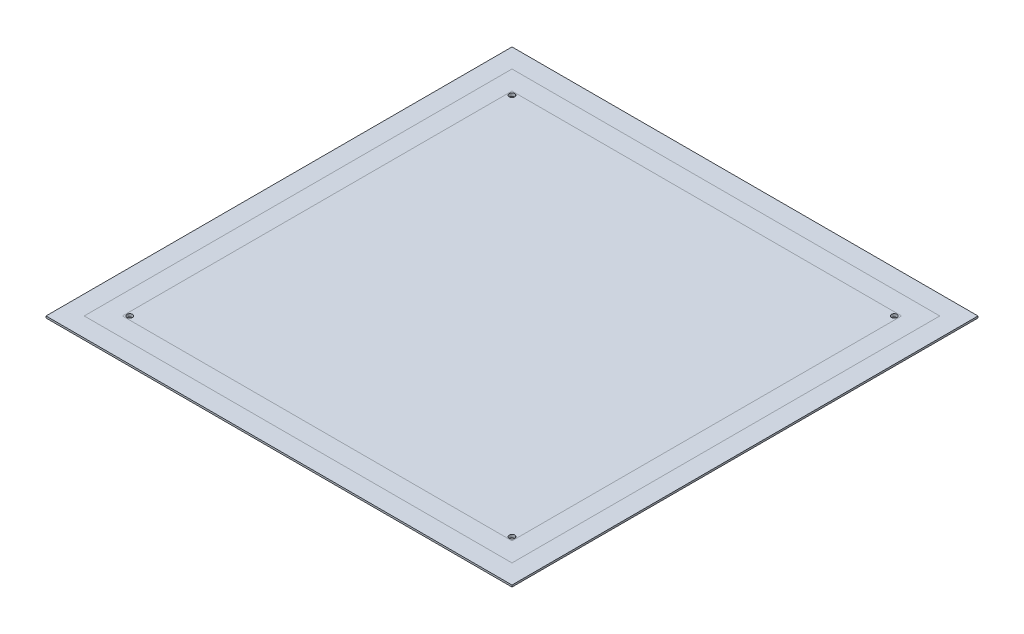
ISO-10303-21;
HEADER;
FILE_DESCRIPTION(('STEP AP214'),'2;1');
FILE_NAME('part.step','',(''),(''),'','','');
FILE_SCHEMA(('AUTOMOTIVE_DESIGN { 1 0 10303 214 1 1 1 1 }'));
ENDSEC;
DATA;
#1=APPLICATION_CONTEXT('core data for automotive mechanical design processes');
#2=APPLICATION_PROTOCOL_DEFINITION('international standard','automotive_design',2000,#1);
#3=PRODUCT_CONTEXT('',#1,'mechanical');
#4=PRODUCT('Part','Part','',(#3));
#5=PRODUCT_RELATED_PRODUCT_CATEGORY('part','',(#4));
#6=PRODUCT_DEFINITION_FORMATION('','',#4);
#7=PRODUCT_DEFINITION_CONTEXT('part definition',#1,'design');
#8=PRODUCT_DEFINITION('design','',#6,#7);
#9=PRODUCT_DEFINITION_SHAPE('','',#8);
#10=(LENGTH_UNIT() NAMED_UNIT(*) SI_UNIT(.MILLI.,.METRE.));
#11=(NAMED_UNIT(*) PLANE_ANGLE_UNIT() SI_UNIT($,.RADIAN.));
#12=(NAMED_UNIT(*) SI_UNIT($,.STERADIAN.) SOLID_ANGLE_UNIT());
#13=UNCERTAINTY_MEASURE_WITH_UNIT(LENGTH_MEASURE(1.E-05),#10,'distance_accuracy_value','');
#14=(GEOMETRIC_REPRESENTATION_CONTEXT(3) GLOBAL_UNCERTAINTY_ASSIGNED_CONTEXT((#13)) GLOBAL_UNIT_ASSIGNED_CONTEXT((#10,
#11,#12)) REPRESENTATION_CONTEXT('',''));
#15=CARTESIAN_POINT('',(0.,0.,0.));
#16=DIRECTION('',(0.,0.,1.));
#17=DIRECTION('',(1.,0.,0.));
#18=AXIS2_PLACEMENT_3D('',#15,#16,#17);
#19=CARTESIAN_POINT('',(-128.,0.6,-128.));
#20=DIRECTION('',(-1.,0.,0.));
#21=DIRECTION('',(0.,0.,1.));
#22=AXIS2_PLACEMENT_3D('',#19,#20,#21);
#23=PLANE('',#22);
#24=DIRECTION('',(0.,0.,1.));
#25=VECTOR('',#24,1.);
#26=CARTESIAN_POINT('',(-128.,1.6,-128.));
#27=LINE('',#26,#25);
#28=CARTESIAN_POINT('',(-128.,1.6,-128.));
#29=VERTEX_POINT('',#28);
#30=CARTESIAN_POINT('',(-128.,1.6,128.));
#31=VERTEX_POINT('',#30);
#32=EDGE_CURVE('E156',#29,#31,#27,.T.);
#33=ORIENTED_EDGE('',*,*,#32,.F.);
#34=DIRECTION('',(0.,1.,0.));
#35=VECTOR('',#34,1.);
#36=CARTESIAN_POINT('',(-128.,0.6,-128.));
#37=LINE('',#36,#35);
#38=CARTESIAN_POINT('',(-128.,0.6,-128.));
#39=VERTEX_POINT('',#38);
#40=EDGE_CURVE('E12',#39,#29,#37,.T.);
#41=ORIENTED_EDGE('',*,*,#40,.F.);
#42=DIRECTION('',(0.,0.,1.));
#43=VECTOR('',#42,1.);
#44=CARTESIAN_POINT('',(-128.,0.6,-128.));
#45=LINE('',#44,#43);
#46=CARTESIAN_POINT('',(-128.,0.6,128.));
#47=VERTEX_POINT('',#46);
#48=EDGE_CURVE('E160',#39,#47,#45,.T.);
#49=ORIENTED_EDGE('',*,*,#48,.T.);
#50=DIRECTION('',(0.,1.,0.));
#51=VECTOR('',#50,1.);
#52=CARTESIAN_POINT('',(-128.,0.6,128.));
#53=LINE('',#52,#51);
#54=EDGE_CURVE('E57',#47,#31,#53,.T.);
#55=ORIENTED_EDGE('',*,*,#54,.T.);
#56=EDGE_LOOP('',(#33,#41,#49,#55));
#57=FACE_BOUND('',#56,.T.);
#58=ADVANCED_FACE('F54',(#57),#23,.T.);
#59=CARTESIAN_POINT('',(128.,0.6,-128.));
#60=DIRECTION('',(0.,0.,-1.));
#61=DIRECTION('',(-1.,0.,0.));
#62=AXIS2_PLACEMENT_3D('',#59,#60,#61);
#63=PLANE('',#62);
#64=DIRECTION('',(-1.,0.,0.));
#65=VECTOR('',#64,1.);
#66=CARTESIAN_POINT('',(128.,1.6,-128.));
#67=LINE('',#66,#65);
#68=CARTESIAN_POINT('',(128.,1.6,-128.));
#69=VERTEX_POINT('',#68);
#70=EDGE_CURVE('E165',#69,#29,#67,.T.);
#71=ORIENTED_EDGE('',*,*,#70,.F.);
#72=DIRECTION('',(0.,1.,0.));
#73=VECTOR('',#72,1.);
#74=CARTESIAN_POINT('',(128.,0.6,-128.));
#75=LINE('',#74,#73);
#76=CARTESIAN_POINT('',(128.,0.6,-128.));
#77=VERTEX_POINT('',#76);
#78=EDGE_CURVE('E62',#77,#69,#75,.T.);
#79=ORIENTED_EDGE('',*,*,#78,.F.);
#80=DIRECTION('',(-1.,0.,0.));
#81=VECTOR('',#80,1.);
#82=CARTESIAN_POINT('',(128.,0.6,-128.));
#83=LINE('',#82,#81);
#84=EDGE_CURVE('E172',#77,#39,#83,.T.);
#85=ORIENTED_EDGE('',*,*,#84,.T.);
#86=ORIENTED_EDGE('',*,*,#40,.T.);
#87=EDGE_LOOP('',(#71,#79,#85,#86));
#88=FACE_BOUND('',#87,.T.);
#89=ADVANCED_FACE('F200',(#88),#63,.T.);
#90=CARTESIAN_POINT('',(128.,0.6,-128.));
#91=DIRECTION('',(1.,0.,0.));
#92=DIRECTION('',(0.,0.,-1.));
#93=AXIS2_PLACEMENT_3D('',#90,#91,#92);
#94=PLANE('',#93);
#95=DIRECTION('',(0.,0.,-1.));
#96=VECTOR('',#95,1.);
#97=CARTESIAN_POINT('',(128.,1.6,-128.));
#98=LINE('',#97,#96);
#99=CARTESIAN_POINT('',(128.,1.6,128.));
#100=VERTEX_POINT('',#99);
#101=EDGE_CURVE('E182',#100,#69,#98,.T.);
#102=ORIENTED_EDGE('',*,*,#101,.F.);
#103=DIRECTION('',(0.,1.,0.));
#104=VECTOR('',#103,1.);
#105=CARTESIAN_POINT('',(128.,0.6,128.));
#106=LINE('',#105,#104);
#107=CARTESIAN_POINT('',(128.,0.6,128.));
#108=VERTEX_POINT('',#107);
#109=EDGE_CURVE('E187',#108,#100,#106,.T.);
#110=ORIENTED_EDGE('',*,*,#109,.F.);
#111=DIRECTION('',(0.,0.,-1.));
#112=VECTOR('',#111,1.);
#113=CARTESIAN_POINT('',(128.,0.6,-128.));
#114=LINE('',#113,#112);
#115=EDGE_CURVE('E169',#108,#77,#114,.T.);
#116=ORIENTED_EDGE('',*,*,#115,.T.);
#117=ORIENTED_EDGE('',*,*,#78,.T.);
#118=EDGE_LOOP('',(#102,#110,#116,#117));
#119=FACE_BOUND('',#118,.T.);
#120=ADVANCED_FACE('F204',(#119),#94,.T.);
#121=CARTESIAN_POINT('',(128.,0.6,128.));
#122=DIRECTION('',(0.,0.,1.));
#123=DIRECTION('',(1.,0.,0.));
#124=AXIS2_PLACEMENT_3D('',#121,#122,#123);
#125=PLANE('',#124);
#126=DIRECTION('',(1.,0.,0.));
#127=VECTOR('',#126,1.);
#128=CARTESIAN_POINT('',(128.,1.6,128.));
#129=LINE('',#128,#127);
#130=EDGE_CURVE('E178',#31,#100,#129,.T.);
#131=ORIENTED_EDGE('',*,*,#130,.F.);
#132=ORIENTED_EDGE('',*,*,#54,.F.);
#133=DIRECTION('',(1.,0.,0.));
#134=VECTOR('',#133,1.);
#135=CARTESIAN_POINT('',(128.,0.6,128.));
#136=LINE('',#135,#134);
#137=EDGE_CURVE('E164',#47,#108,#136,.T.);
#138=ORIENTED_EDGE('',*,*,#137,.T.);
#139=ORIENTED_EDGE('',*,*,#109,.T.);
#140=EDGE_LOOP('',(#131,#132,#138,#139));
#141=FACE_BOUND('',#140,.T.);
#142=ADVANCED_FACE('F195',(#141),#125,.T.);
#143=CARTESIAN_POINT('',(0.,0.6,0.));
#144=DIRECTION('',(0.,-1.,0.));
#145=DIRECTION('',(0.,0.,-1.));
#146=AXIS2_PLACEMENT_3D('',#143,#144,#145);
#147=PLANE('',#146);
#148=DIRECTION('',(-1.,0.,0.));
#149=VECTOR('',#148,1.);
#150=CARTESIAN_POINT('',(117.5,0.6,-117.5));
#151=LINE('',#150,#149);
#152=CARTESIAN_POINT('',(117.5,0.6,-117.5));
#153=VERTEX_POINT('',#152);
#154=CARTESIAN_POINT('',(-117.5,0.6,-117.5));
#155=VERTEX_POINT('',#154);
#156=EDGE_CURVE('E121',#153,#155,#151,.T.);
#157=ORIENTED_EDGE('',*,*,#156,.T.);
#158=DIRECTION('',(0.,0.,1.));
#159=VECTOR('',#158,1.);
#160=CARTESIAN_POINT('',(-117.5,0.6,-117.5));
#161=LINE('',#160,#159);
#162=CARTESIAN_POINT('',(-117.5,0.6,117.5));
#163=VERTEX_POINT('',#162);
#164=EDGE_CURVE('E130',#155,#163,#161,.T.);
#165=ORIENTED_EDGE('',*,*,#164,.T.);
#166=DIRECTION('',(1.,0.,0.));
#167=VECTOR('',#166,1.);
#168=CARTESIAN_POINT('',(-117.5,0.6,117.5));
#169=LINE('',#168,#167);
#170=CARTESIAN_POINT('',(117.5,0.6,117.5));
#171=VERTEX_POINT('',#170);
#172=EDGE_CURVE('E70',#163,#171,#169,.T.);
#173=ORIENTED_EDGE('',*,*,#172,.T.);
#174=DIRECTION('',(0.,0.,-1.));
#175=VECTOR('',#174,1.);
#176=CARTESIAN_POINT('',(117.5,0.6,117.5));
#177=LINE('',#176,#175);
#178=EDGE_CURVE('E127',#171,#153,#177,.T.);
#179=ORIENTED_EDGE('',*,*,#178,.T.);
#180=EDGE_LOOP('',(#157,#165,#173,#179));
#181=FACE_BOUND('',#180,.T.);
#182=ORIENTED_EDGE('',*,*,#48,.F.);
#183=ORIENTED_EDGE('',*,*,#84,.F.);
#184=ORIENTED_EDGE('',*,*,#115,.F.);
#185=ORIENTED_EDGE('',*,*,#137,.F.);
#186=EDGE_LOOP('',(#182,#183,#184,#185));
#187=FACE_BOUND('',#186,.T.);
#188=ADVANCED_FACE('F135',(#181,#187),#147,.T.);
#189=CARTESIAN_POINT('',(0.,1.6,0.));
#190=DIRECTION('',(0.,-1.,0.));
#191=DIRECTION('',(0.,0.,-1.));
#192=AXIS2_PLACEMENT_3D('',#189,#190,#191);
#193=PLANE('',#192);
#194=DIRECTION('',(0.,0.,1.));
#195=VECTOR('',#194,1.);
#196=CARTESIAN_POINT('',(-117.5,1.6,-117.5));
#197=LINE('',#196,#195);
#198=CARTESIAN_POINT('',(-117.5,1.6,-117.5));
#199=VERTEX_POINT('',#198);
#200=CARTESIAN_POINT('',(-117.5,1.6,117.5));
#201=VERTEX_POINT('',#200);
#202=EDGE_CURVE('E148',#199,#201,#197,.T.);
#203=ORIENTED_EDGE('',*,*,#202,.F.);
#204=DIRECTION('',(-1.,0.,0.));
#205=VECTOR('',#204,1.);
#206=CARTESIAN_POINT('',(117.5,1.6,-117.5));
#207=LINE('',#206,#205);
#208=CARTESIAN_POINT('',(117.5,1.6,-117.5));
#209=VERTEX_POINT('',#208);
#210=EDGE_CURVE('E78',#209,#199,#207,.T.);
#211=ORIENTED_EDGE('',*,*,#210,.F.);
#212=DIRECTION('',(0.,0.,-1.));
#213=VECTOR('',#212,1.);
#214=CARTESIAN_POINT('',(117.5,1.6,117.5));
#215=LINE('',#214,#213);
#216=CARTESIAN_POINT('',(117.5,1.6,117.5));
#217=VERTEX_POINT('',#216);
#218=EDGE_CURVE('E138',#217,#209,#215,.T.);
#219=ORIENTED_EDGE('',*,*,#218,.F.);
#220=DIRECTION('',(1.,0.,0.));
#221=VECTOR('',#220,1.);
#222=CARTESIAN_POINT('',(-117.5,1.6,117.5));
#223=LINE('',#222,#221);
#224=EDGE_CURVE('E141',#201,#217,#223,.T.);
#225=ORIENTED_EDGE('',*,*,#224,.F.);
#226=EDGE_LOOP('',(#203,#211,#219,#225));
#227=FACE_BOUND('',#226,.T.);
#228=ORIENTED_EDGE('',*,*,#32,.T.);
#229=ORIENTED_EDGE('',*,*,#130,.T.);
#230=ORIENTED_EDGE('',*,*,#101,.T.);
#231=ORIENTED_EDGE('',*,*,#70,.T.);
#232=EDGE_LOOP('',(#228,#229,#230,#231));
#233=FACE_BOUND('',#232,.T.);
#234=ADVANCED_FACE('F197',(#227,#233),#193,.F.);
#235=CARTESIAN_POINT('',(117.5,0.6,-117.5));
#236=DIRECTION('',(0.,0.,-1.));
#237=DIRECTION('',(-1.,0.,0.));
#238=AXIS2_PLACEMENT_3D('',#235,#236,#237);
#239=PLANE('',#238);
#240=ORIENTED_EDGE('',*,*,#210,.T.);
#241=DIRECTION('',(0.,1.,0.));
#242=VECTOR('',#241,1.);
#243=CARTESIAN_POINT('',(-117.5,0.6,-117.5));
#244=LINE('',#243,#242);
#245=EDGE_CURVE('E117',#155,#199,#244,.T.);
#246=ORIENTED_EDGE('',*,*,#245,.F.);
#247=ORIENTED_EDGE('',*,*,#156,.F.);
#248=DIRECTION('',(0.,1.,0.));
#249=VECTOR('',#248,1.);
#250=CARTESIAN_POINT('',(117.5,0.6,-117.5));
#251=LINE('',#250,#249);
#252=EDGE_CURVE('E154',#153,#209,#251,.T.);
#253=ORIENTED_EDGE('',*,*,#252,.T.);
#254=EDGE_LOOP('',(#240,#246,#247,#253));
#255=FACE_BOUND('',#254,.T.);
#256=ADVANCED_FACE('F119',(#255),#239,.F.);
#257=CARTESIAN_POINT('',(117.5,0.6,117.5));
#258=DIRECTION('',(1.,0.,0.));
#259=DIRECTION('',(0.,0.,-1.));
#260=AXIS2_PLACEMENT_3D('',#257,#258,#259);
#261=PLANE('',#260);
#262=ORIENTED_EDGE('',*,*,#218,.T.);
#263=ORIENTED_EDGE('',*,*,#252,.F.);
#264=ORIENTED_EDGE('',*,*,#178,.F.);
#265=DIRECTION('',(0.,1.,0.));
#266=VECTOR('',#265,1.);
#267=CARTESIAN_POINT('',(117.5,0.6,117.5));
#268=LINE('',#267,#266);
#269=EDGE_CURVE('E157',#171,#217,#268,.T.);
#270=ORIENTED_EDGE('',*,*,#269,.T.);
#271=EDGE_LOOP('',(#262,#263,#264,#270));
#272=FACE_BOUND('',#271,.T.);
#273=ADVANCED_FACE('F255',(#272),#261,.F.);
#274=CARTESIAN_POINT('',(-117.5,0.6,117.5));
#275=DIRECTION('',(0.,0.,1.));
#276=DIRECTION('',(1.,0.,0.));
#277=AXIS2_PLACEMENT_3D('',#274,#275,#276);
#278=PLANE('',#277);
#279=ORIENTED_EDGE('',*,*,#224,.T.);
#280=ORIENTED_EDGE('',*,*,#269,.F.);
#281=ORIENTED_EDGE('',*,*,#172,.F.);
#282=DIRECTION('',(0.,1.,0.));
#283=VECTOR('',#282,1.);
#284=CARTESIAN_POINT('',(-117.5,0.6,117.5));
#285=LINE('',#284,#283);
#286=EDGE_CURVE('E126',#163,#201,#285,.T.);
#287=ORIENTED_EDGE('',*,*,#286,.T.);
#288=EDGE_LOOP('',(#279,#280,#281,#287));
#289=FACE_BOUND('',#288,.T.);
#290=ADVANCED_FACE('F264',(#289),#278,.F.);
#291=CARTESIAN_POINT('',(-117.5,0.6,-117.5));
#292=DIRECTION('',(-1.,0.,0.));
#293=DIRECTION('',(0.,0.,1.));
#294=AXIS2_PLACEMENT_3D('',#291,#292,#293);
#295=PLANE('',#294);
#296=ORIENTED_EDGE('',*,*,#202,.T.);
#297=ORIENTED_EDGE('',*,*,#286,.F.);
#298=ORIENTED_EDGE('',*,*,#164,.F.);
#299=ORIENTED_EDGE('',*,*,#245,.T.);
#300=EDGE_LOOP('',(#296,#297,#298,#299));
#301=FACE_BOUND('',#300,.T.);
#302=ADVANCED_FACE('F131',(#301),#295,.F.);
#303=CLOSED_SHELL('',(#58,#89,#120,#142,#188,#234,#256,#273,#290,#302));
#304=MANIFOLD_SOLID_BREP('B2',#303);
#305=CARTESIAN_POINT('',(-117.5,0.6,-117.5));
#306=DIRECTION('',(-1.,0.,0.));
#307=DIRECTION('',(0.,0.,1.));
#308=AXIS2_PLACEMENT_3D('',#305,#306,#307);
#309=PLANE('',#308);
#310=DIRECTION('',(0.,0.,1.));
#311=VECTOR('',#310,1.);
#312=CARTESIAN_POINT('',(-117.5,1.6,-117.5));
#313=LINE('',#312,#311);
#314=CARTESIAN_POINT('',(-117.5,1.6,-117.5));
#315=VERTEX_POINT('',#314);
#316=CARTESIAN_POINT('',(-117.5,1.6,117.5));
#317=VERTEX_POINT('',#316);
#318=EDGE_CURVE('E403',#315,#317,#313,.T.);
#319=ORIENTED_EDGE('',*,*,#318,.F.);
#320=DIRECTION('',(0.,1.,0.));
#321=VECTOR('',#320,1.);
#322=CARTESIAN_POINT('',(-117.5,0.6,-117.5));
#323=LINE('',#322,#321);
#324=CARTESIAN_POINT('',(-117.5,0.6,-117.5));
#325=VERTEX_POINT('',#324);
#326=EDGE_CURVE('E52',#325,#315,#323,.T.);
#327=ORIENTED_EDGE('',*,*,#326,.F.);
#328=DIRECTION('',(0.,0.,1.));
#329=VECTOR('',#328,1.);
#330=CARTESIAN_POINT('',(-117.5,0.6,-117.5));
#331=LINE('',#330,#329);
#332=CARTESIAN_POINT('',(-117.5,0.6,117.5));
#333=VERTEX_POINT('',#332);
#334=EDGE_CURVE('E407',#325,#333,#331,.T.);
#335=ORIENTED_EDGE('',*,*,#334,.T.);
#336=DIRECTION('',(0.,1.,0.));
#337=VECTOR('',#336,1.);
#338=CARTESIAN_POINT('',(-117.5,0.6,117.5));
#339=LINE('',#338,#337);
#340=EDGE_CURVE('E304',#333,#317,#339,.T.);
#341=ORIENTED_EDGE('',*,*,#340,.T.);
#342=EDGE_LOOP('',(#319,#327,#335,#341));
#343=FACE_BOUND('',#342,.T.);
#344=ADVANCED_FACE('F301',(#343),#309,.T.);
#345=CARTESIAN_POINT('',(117.5,0.6,-117.5));
#346=DIRECTION('',(0.,0.,-1.));
#347=DIRECTION('',(-1.,0.,0.));
#348=AXIS2_PLACEMENT_3D('',#345,#346,#347);
#349=PLANE('',#348);
#350=DIRECTION('',(-1.,0.,0.));
#351=VECTOR('',#350,1.);
#352=CARTESIAN_POINT('',(117.5,1.6,-117.5));
#353=LINE('',#352,#351);
#354=CARTESIAN_POINT('',(117.5,1.6,-117.5));
#355=VERTEX_POINT('',#354);
#356=EDGE_CURVE('E412',#355,#315,#353,.T.);
#357=ORIENTED_EDGE('',*,*,#356,.F.);
#358=DIRECTION('',(0.,1.,0.));
#359=VECTOR('',#358,1.);
#360=CARTESIAN_POINT('',(117.5,0.6,-117.5));
#361=LINE('',#360,#359);
#362=CARTESIAN_POINT('',(117.5,0.6,-117.5));
#363=VERTEX_POINT('',#362);
#364=EDGE_CURVE('E309',#363,#355,#361,.T.);
#365=ORIENTED_EDGE('',*,*,#364,.F.);
#366=DIRECTION('',(-1.,0.,0.));
#367=VECTOR('',#366,1.);
#368=CARTESIAN_POINT('',(117.5,0.6,-117.5));
#369=LINE('',#368,#367);
#370=EDGE_CURVE('E419',#363,#325,#369,.T.);
#371=ORIENTED_EDGE('',*,*,#370,.T.);
#372=ORIENTED_EDGE('',*,*,#326,.T.);
#373=EDGE_LOOP('',(#357,#365,#371,#372));
#374=FACE_BOUND('',#373,.T.);
#375=ADVANCED_FACE('F447',(#374),#349,.T.);
#376=CARTESIAN_POINT('',(117.5,0.6,-117.5));
#377=DIRECTION('',(1.,0.,0.));
#378=DIRECTION('',(0.,0.,-1.));
#379=AXIS2_PLACEMENT_3D('',#376,#377,#378);
#380=PLANE('',#379);
#381=DIRECTION('',(0.,0.,-1.));
#382=VECTOR('',#381,1.);
#383=CARTESIAN_POINT('',(117.5,1.6,-117.5));
#384=LINE('',#383,#382);
#385=CARTESIAN_POINT('',(117.5,1.6,117.5));
#386=VERTEX_POINT('',#385);
#387=EDGE_CURVE('E429',#386,#355,#384,.T.);
#388=ORIENTED_EDGE('',*,*,#387,.F.);
#389=DIRECTION('',(0.,1.,0.));
#390=VECTOR('',#389,1.);
#391=CARTESIAN_POINT('',(117.5,0.6,117.5));
#392=LINE('',#391,#390);
#393=CARTESIAN_POINT('',(117.5,0.6,117.5));
#394=VERTEX_POINT('',#393);
#395=EDGE_CURVE('E434',#394,#386,#392,.T.);
#396=ORIENTED_EDGE('',*,*,#395,.F.);
#397=DIRECTION('',(0.,0.,-1.));
#398=VECTOR('',#397,1.);
#399=CARTESIAN_POINT('',(117.5,0.6,-117.5));
#400=LINE('',#399,#398);
#401=EDGE_CURVE('E416',#394,#363,#400,.T.);
#402=ORIENTED_EDGE('',*,*,#401,.T.);
#403=ORIENTED_EDGE('',*,*,#364,.T.);
#404=EDGE_LOOP('',(#388,#396,#402,#403));
#405=FACE_BOUND('',#404,.T.);
#406=ADVANCED_FACE('F451',(#405),#380,.T.);
#407=CARTESIAN_POINT('',(117.5,0.6,117.5));
#408=DIRECTION('',(0.,0.,1.));
#409=DIRECTION('',(1.,0.,0.));
#410=AXIS2_PLACEMENT_3D('',#407,#408,#409);
#411=PLANE('',#410);
#412=DIRECTION('',(1.,0.,0.));
#413=VECTOR('',#412,1.);
#414=CARTESIAN_POINT('',(117.5,1.6,117.5));
#415=LINE('',#414,#413);
#416=EDGE_CURVE('E425',#317,#386,#415,.T.);
#417=ORIENTED_EDGE('',*,*,#416,.F.);
#418=ORIENTED_EDGE('',*,*,#340,.F.);
#419=DIRECTION('',(1.,0.,0.));
#420=VECTOR('',#419,1.);
#421=CARTESIAN_POINT('',(117.5,0.6,117.5));
#422=LINE('',#421,#420);
#423=EDGE_CURVE('E411',#333,#394,#422,.T.);
#424=ORIENTED_EDGE('',*,*,#423,.T.);
#425=ORIENTED_EDGE('',*,*,#395,.T.);
#426=EDGE_LOOP('',(#417,#418,#424,#425));
#427=FACE_BOUND('',#426,.T.);
#428=ADVANCED_FACE('F442',(#427),#411,.T.);
#429=CARTESIAN_POINT('',(0.,0.6,0.));
#430=DIRECTION('',(0.,-1.,0.));
#431=DIRECTION('',(0.,0.,-1.));
#432=AXIS2_PLACEMENT_3D('',#429,#430,#431);
#433=PLANE('',#432);
#434=DIRECTION('',(0.,0.,-1.));
#435=VECTOR('',#434,1.);
#436=CARTESIAN_POINT('',(107.,0.6,107.));
#437=LINE('',#436,#435);
#438=CARTESIAN_POINT('',(107.,0.6,107.));
#439=VERTEX_POINT('',#438);
#440=CARTESIAN_POINT('',(107.,0.6,-107.));
#441=VERTEX_POINT('',#440);
#442=EDGE_CURVE('E368',#439,#441,#437,.T.);
#443=ORIENTED_EDGE('',*,*,#442,.T.);
#444=DIRECTION('',(-1.,0.,0.));
#445=VECTOR('',#444,1.);
#446=CARTESIAN_POINT('',(107.,0.6,-107.));
#447=LINE('',#446,#445);
#448=CARTESIAN_POINT('',(-107.,0.6,-107.));
#449=VERTEX_POINT('',#448);
#450=EDGE_CURVE('E377',#441,#449,#447,.T.);
#451=ORIENTED_EDGE('',*,*,#450,.T.);
#452=DIRECTION('',(0.,0.,1.));
#453=VECTOR('',#452,1.);
#454=CARTESIAN_POINT('',(-107.,0.6,-107.));
#455=LINE('',#454,#453);
#456=CARTESIAN_POINT('',(-107.,0.6,107.));
#457=VERTEX_POINT('',#456);
#458=EDGE_CURVE('E317',#449,#457,#455,.T.);
#459=ORIENTED_EDGE('',*,*,#458,.T.);
#460=DIRECTION('',(1.,0.,0.));
#461=VECTOR('',#460,1.);
#462=CARTESIAN_POINT('',(-107.,0.6,107.));
#463=LINE('',#462,#461);
#464=EDGE_CURVE('E374',#457,#439,#463,.T.);
#465=ORIENTED_EDGE('',*,*,#464,.T.);
#466=EDGE_LOOP('',(#443,#451,#459,#465));
#467=FACE_BOUND('',#466,.T.);
#468=ORIENTED_EDGE('',*,*,#334,.F.);
#469=ORIENTED_EDGE('',*,*,#370,.F.);
#470=ORIENTED_EDGE('',*,*,#401,.F.);
#471=ORIENTED_EDGE('',*,*,#423,.F.);
#472=EDGE_LOOP('',(#468,#469,#470,#471));
#473=FACE_BOUND('',#472,.T.);
#474=ADVANCED_FACE('F381',(#467,#473),#433,.T.);
#475=CARTESIAN_POINT('',(0.,1.6,0.));
#476=DIRECTION('',(0.,-1.,0.));
#477=DIRECTION('',(0.,0.,-1.));
#478=AXIS2_PLACEMENT_3D('',#475,#476,#477);
#479=PLANE('',#478);
#480=DIRECTION('',(-1.,0.,0.));
#481=VECTOR('',#480,1.);
#482=CARTESIAN_POINT('',(107.,1.6,-107.));
#483=LINE('',#482,#481);
#484=CARTESIAN_POINT('',(107.,1.6,-107.));
#485=VERTEX_POINT('',#484);
#486=CARTESIAN_POINT('',(-107.,1.6,-107.));
#487=VERTEX_POINT('',#486);
#488=EDGE_CURVE('E396',#485,#487,#483,.T.);
#489=ORIENTED_EDGE('',*,*,#488,.F.);
#490=DIRECTION('',(0.,0.,-1.));
#491=VECTOR('',#490,1.);
#492=CARTESIAN_POINT('',(107.,1.6,107.));
#493=LINE('',#492,#491);
#494=CARTESIAN_POINT('',(107.,1.6,107.));
#495=VERTEX_POINT('',#494);
#496=EDGE_CURVE('E325',#495,#485,#493,.T.);
#497=ORIENTED_EDGE('',*,*,#496,.F.);
#498=DIRECTION('',(1.,0.,0.));
#499=VECTOR('',#498,1.);
#500=CARTESIAN_POINT('',(-107.,1.6,107.));
#501=LINE('',#500,#499);
#502=CARTESIAN_POINT('',(-107.,1.6,107.));
#503=VERTEX_POINT('',#502);
#504=EDGE_CURVE('E384',#503,#495,#501,.T.);
#505=ORIENTED_EDGE('',*,*,#504,.F.);
#506=DIRECTION('',(0.,0.,1.));
#507=VECTOR('',#506,1.);
#508=CARTESIAN_POINT('',(-107.,1.6,-107.));
#509=LINE('',#508,#507);
#510=EDGE_CURVE('E388',#487,#503,#509,.T.);
#511=ORIENTED_EDGE('',*,*,#510,.F.);
#512=EDGE_LOOP('',(#489,#497,#505,#511));
#513=FACE_BOUND('',#512,.T.);
#514=ORIENTED_EDGE('',*,*,#318,.T.);
#515=ORIENTED_EDGE('',*,*,#416,.T.);
#516=ORIENTED_EDGE('',*,*,#387,.T.);
#517=ORIENTED_EDGE('',*,*,#356,.T.);
#518=EDGE_LOOP('',(#514,#515,#516,#517));
#519=FACE_BOUND('',#518,.T.);
#520=ADVANCED_FACE('F444',(#513,#519),#479,.F.);
#521=CARTESIAN_POINT('',(107.,0.6,107.));
#522=DIRECTION('',(1.,0.,0.));
#523=DIRECTION('',(0.,0.,-1.));
#524=AXIS2_PLACEMENT_3D('',#521,#522,#523);
#525=PLANE('',#524);
#526=ORIENTED_EDGE('',*,*,#496,.T.);
#527=DIRECTION('',(0.,1.,0.));
#528=VECTOR('',#527,1.);
#529=CARTESIAN_POINT('',(107.,0.6,-107.));
#530=LINE('',#529,#528);
#531=EDGE_CURVE('E364',#441,#485,#530,.T.);
#532=ORIENTED_EDGE('',*,*,#531,.F.);
#533=ORIENTED_EDGE('',*,*,#442,.F.);
#534=DIRECTION('',(0.,1.,0.));
#535=VECTOR('',#534,1.);
#536=CARTESIAN_POINT('',(107.,0.6,107.));
#537=LINE('',#536,#535);
#538=EDGE_CURVE('E401',#439,#495,#537,.T.);
#539=ORIENTED_EDGE('',*,*,#538,.T.);
#540=EDGE_LOOP('',(#526,#532,#533,#539));
#541=FACE_BOUND('',#540,.T.);
#542=ADVANCED_FACE('F366',(#541),#525,.F.);
#543=CARTESIAN_POINT('',(-107.,0.6,107.));
#544=DIRECTION('',(0.,0.,1.));
#545=DIRECTION('',(1.,0.,0.));
#546=AXIS2_PLACEMENT_3D('',#543,#544,#545);
#547=PLANE('',#546);
#548=ORIENTED_EDGE('',*,*,#504,.T.);
#549=ORIENTED_EDGE('',*,*,#538,.F.);
#550=ORIENTED_EDGE('',*,*,#464,.F.);
#551=DIRECTION('',(0.,1.,0.));
#552=VECTOR('',#551,1.);
#553=CARTESIAN_POINT('',(-107.,0.6,107.));
#554=LINE('',#553,#552);
#555=EDGE_CURVE('E404',#457,#503,#554,.T.);
#556=ORIENTED_EDGE('',*,*,#555,.T.);
#557=EDGE_LOOP('',(#548,#549,#550,#556));
#558=FACE_BOUND('',#557,.T.);
#559=ADVANCED_FACE('F502',(#558),#547,.F.);
#560=CARTESIAN_POINT('',(-107.,0.6,-107.));
#561=DIRECTION('',(-1.,0.,0.));
#562=DIRECTION('',(0.,0.,1.));
#563=AXIS2_PLACEMENT_3D('',#560,#561,#562);
#564=PLANE('',#563);
#565=ORIENTED_EDGE('',*,*,#510,.T.);
#566=ORIENTED_EDGE('',*,*,#555,.F.);
#567=ORIENTED_EDGE('',*,*,#458,.F.);
#568=DIRECTION('',(0.,1.,0.));
#569=VECTOR('',#568,1.);
#570=CARTESIAN_POINT('',(-107.,0.6,-107.));
#571=LINE('',#570,#569);
#572=EDGE_CURVE('E373',#449,#487,#571,.T.);
#573=ORIENTED_EDGE('',*,*,#572,.T.);
#574=EDGE_LOOP('',(#565,#566,#567,#573));
#575=FACE_BOUND('',#574,.T.);
#576=ADVANCED_FACE('F511',(#575),#564,.F.);
#577=CARTESIAN_POINT('',(107.,0.6,-107.));
#578=DIRECTION('',(0.,0.,-1.));
#579=DIRECTION('',(-1.,0.,0.));
#580=AXIS2_PLACEMENT_3D('',#577,#578,#579);
#581=PLANE('',#580);
#582=ORIENTED_EDGE('',*,*,#488,.T.);
#583=ORIENTED_EDGE('',*,*,#572,.F.);
#584=ORIENTED_EDGE('',*,*,#450,.F.);
#585=ORIENTED_EDGE('',*,*,#531,.T.);
#586=EDGE_LOOP('',(#582,#583,#584,#585));
#587=FACE_BOUND('',#586,.T.);
#588=ADVANCED_FACE('F378',(#587),#581,.F.);
#589=CLOSED_SHELL('',(#344,#375,#406,#428,#474,#520,#542,#559,#576,#588));
#590=MANIFOLD_SOLID_BREP('B6',#589);
#591=CARTESIAN_POINT('',(107.,1.6,-107.));
#592=DIRECTION('',(0.,0.,1.));
#593=DIRECTION('',(1.,0.,0.));
#594=AXIS2_PLACEMENT_3D('',#591,#592,#593);
#595=PLANE('',#594);
#596=DIRECTION('',(-1.,0.,0.));
#597=VECTOR('',#596,1.);
#598=CARTESIAN_POINT('',(107.,0.,-107.));
#599=LINE('',#598,#597);
#600=CARTESIAN_POINT('',(107.,0.,-107.));
#601=VERTEX_POINT('',#600);
#602=CARTESIAN_POINT('',(-107.,0.,-107.));
#603=VERTEX_POINT('',#602);
#604=EDGE_CURVE('E604',#601,#603,#599,.T.);
#605=ORIENTED_EDGE('',*,*,#604,.T.);
#606=DIRECTION('',(0.,-1.,0.));
#607=VECTOR('',#606,1.);
#608=CARTESIAN_POINT('',(-107.,1.6,-107.));
#609=LINE('',#608,#607);
#610=CARTESIAN_POINT('',(-107.,1.6,-107.));
#611=VERTEX_POINT('',#610);
#612=EDGE_CURVE('E299',#611,#603,#609,.T.);
#613=ORIENTED_EDGE('',*,*,#612,.F.);
#614=DIRECTION('',(-1.,0.,0.));
#615=VECTOR('',#614,1.);
#616=CARTESIAN_POINT('',(107.,1.6,-107.));
#617=LINE('',#616,#615);
#618=CARTESIAN_POINT('',(107.,1.6,-107.));
#619=VERTEX_POINT('',#618);
#620=EDGE_CURVE('E587',#619,#611,#617,.T.);
#621=ORIENTED_EDGE('',*,*,#620,.F.);
#622=DIRECTION('',(0.,-1.,0.));
#623=VECTOR('',#622,1.);
#624=CARTESIAN_POINT('',(107.,1.6,-107.));
#625=LINE('',#624,#623);
#626=EDGE_CURVE('E554',#619,#601,#625,.T.);
#627=ORIENTED_EDGE('',*,*,#626,.T.);
#628=EDGE_LOOP('',(#605,#613,#621,#627));
#629=FACE_BOUND('',#628,.T.);
#630=ADVANCED_FACE('F538',(#629),#595,.F.);
#631=CARTESIAN_POINT('',(-107.,1.6,-107.));
#632=DIRECTION('',(1.,0.,0.));
#633=DIRECTION('',(0.,0.,-1.));
#634=AXIS2_PLACEMENT_3D('',#631,#632,#633);
#635=PLANE('',#634);
#636=DIRECTION('',(0.,0.,1.));
#637=VECTOR('',#636,1.);
#638=CARTESIAN_POINT('',(-107.,0.,-107.));
#639=LINE('',#638,#637);
#640=CARTESIAN_POINT('',(-107.,0.,107.));
#641=VERTEX_POINT('',#640);
#642=EDGE_CURVE('E593',#603,#641,#639,.T.);
#643=ORIENTED_EDGE('',*,*,#642,.T.);
#644=DIRECTION('',(0.,-1.,0.));
#645=VECTOR('',#644,1.);
#646=CARTESIAN_POINT('',(-107.,1.6,107.));
#647=LINE('',#646,#645);
#648=CARTESIAN_POINT('',(-107.,1.6,107.));
#649=VERTEX_POINT('',#648);
#650=EDGE_CURVE('E546',#649,#641,#647,.T.);
#651=ORIENTED_EDGE('',*,*,#650,.F.);
#652=DIRECTION('',(0.,0.,1.));
#653=VECTOR('',#652,1.);
#654=CARTESIAN_POINT('',(-107.,1.6,-107.));
#655=LINE('',#654,#653);
#656=EDGE_CURVE('E579',#611,#649,#655,.T.);
#657=ORIENTED_EDGE('',*,*,#656,.F.);
#658=ORIENTED_EDGE('',*,*,#612,.T.);
#659=EDGE_LOOP('',(#643,#651,#657,#658));
#660=FACE_BOUND('',#659,.T.);
#661=ADVANCED_FACE('F592',(#660),#635,.F.);
#662=CARTESIAN_POINT('',(107.,1.6,107.));
#663=DIRECTION('',(0.,0.,1.));
#664=DIRECTION('',(1.,0.,0.));
#665=AXIS2_PLACEMENT_3D('',#662,#663,#664);
#666=PLANE('',#665);
#667=DIRECTION('',(-1.,0.,0.));
#668=VECTOR('',#667,1.);
#669=CARTESIAN_POINT('',(107.,0.,107.));
#670=LINE('',#669,#668);
#671=CARTESIAN_POINT('',(107.,0.,107.));
#672=VERTEX_POINT('',#671);
#673=EDGE_CURVE('E609',#672,#641,#670,.T.);
#674=ORIENTED_EDGE('',*,*,#673,.F.);
#675=DIRECTION('',(0.,-1.,0.));
#676=VECTOR('',#675,1.);
#677=CARTESIAN_POINT('',(107.,1.6,107.));
#678=LINE('',#677,#676);
#679=CARTESIAN_POINT('',(107.,1.6,107.));
#680=VERTEX_POINT('',#679);
#681=EDGE_CURVE('E568',#680,#672,#678,.T.);
#682=ORIENTED_EDGE('',*,*,#681,.F.);
#683=DIRECTION('',(-1.,0.,0.));
#684=VECTOR('',#683,1.);
#685=CARTESIAN_POINT('',(107.,1.6,107.));
#686=LINE('',#685,#684);
#687=EDGE_CURVE('E586',#680,#649,#686,.T.);
#688=ORIENTED_EDGE('',*,*,#687,.T.);
#689=ORIENTED_EDGE('',*,*,#650,.T.);
#690=EDGE_LOOP('',(#674,#682,#688,#689));
#691=FACE_BOUND('',#690,.T.);
#692=ADVANCED_FACE('F596',(#691),#666,.T.);
#693=CARTESIAN_POINT('',(107.,1.6,-107.));
#694=DIRECTION('',(1.,0.,0.));
#695=DIRECTION('',(0.,0.,-1.));
#696=AXIS2_PLACEMENT_3D('',#693,#694,#695);
#697=PLANE('',#696);
#698=DIRECTION('',(0.,0.,1.));
#699=VECTOR('',#698,1.);
#700=CARTESIAN_POINT('',(107.,0.,-107.));
#701=LINE('',#700,#699);
#702=EDGE_CURVE('E611',#601,#672,#701,.T.);
#703=ORIENTED_EDGE('',*,*,#702,.F.);
#704=ORIENTED_EDGE('',*,*,#626,.F.);
#705=DIRECTION('',(0.,0.,1.));
#706=VECTOR('',#705,1.);
#707=CARTESIAN_POINT('',(107.,1.6,-107.));
#708=LINE('',#707,#706);
#709=EDGE_CURVE('E598',#619,#680,#708,.T.);
#710=ORIENTED_EDGE('',*,*,#709,.T.);
#711=ORIENTED_EDGE('',*,*,#681,.T.);
#712=EDGE_LOOP('',(#703,#704,#710,#711));
#713=FACE_BOUND('',#712,.T.);
#714=ADVANCED_FACE('F647',(#713),#697,.T.);
#715=CARTESIAN_POINT('',(0.,1.6,0.));
#716=DIRECTION('',(0.,1.,0.));
#717=DIRECTION('',(0.,0.,1.));
#718=AXIS2_PLACEMENT_3D('',#715,#716,#717);
#719=PLANE('',#718);
#720=CARTESIAN_POINT('',(-105.,1.6,-105.));
#721=DIRECTION('',(0.,1.,0.));
#722=DIRECTION('',(0.,0.,1.));
#723=AXIS2_PLACEMENT_3D('',#720,#721,#722);
#724=CIRCLE('',#723,1.55);
#725=CARTESIAN_POINT('',(-105.,1.6,-103.45));
#726=VERTEX_POINT('',#725);
#727=EDGE_CURVE('E637',#726,#726,#724,.T.);
#728=ORIENTED_EDGE('',*,*,#727,.F.);
#729=EDGE_LOOP('',(#728));
#730=FACE_BOUND('',#729,.T.);
#731=CARTESIAN_POINT('',(105.,1.6,-105.));
#732=DIRECTION('',(0.,1.,0.));
#733=DIRECTION('',(0.,0.,1.));
#734=AXIS2_PLACEMENT_3D('',#731,#732,#733);
#735=CIRCLE('',#734,1.55);
#736=CARTESIAN_POINT('',(105.,1.6,-103.45));
#737=VERTEX_POINT('',#736);
#738=EDGE_CURVE('E631',#737,#737,#735,.T.);
#739=ORIENTED_EDGE('',*,*,#738,.F.);
#740=EDGE_LOOP('',(#739));
#741=FACE_BOUND('',#740,.T.);
#742=CARTESIAN_POINT('',(105.,1.6,105.000000000002));
#743=DIRECTION('',(0.,1.,0.));
#744=DIRECTION('',(0.,0.,1.));
#745=AXIS2_PLACEMENT_3D('',#742,#743,#744);
#746=CIRCLE('',#745,1.55);
#747=CARTESIAN_POINT('',(105.,1.6,106.550000000002));
#748=VERTEX_POINT('',#747);
#749=EDGE_CURVE('E625',#748,#748,#746,.T.);
#750=ORIENTED_EDGE('',*,*,#749,.F.);
#751=EDGE_LOOP('',(#750));
#752=FACE_BOUND('',#751,.T.);
#753=CARTESIAN_POINT('',(-104.999999999998,1.6,105.));
#754=DIRECTION('',(0.,1.,0.));
#755=DIRECTION('',(0.,0.,1.));
#756=AXIS2_PLACEMENT_3D('',#753,#754,#755);
#757=CIRCLE('',#756,1.55);
#758=CARTESIAN_POINT('',(-104.999999999998,1.6,106.55));
#759=VERTEX_POINT('',#758);
#760=EDGE_CURVE('E619',#759,#759,#757,.T.);
#761=ORIENTED_EDGE('',*,*,#760,.F.);
#762=EDGE_LOOP('',(#761));
#763=FACE_BOUND('',#762,.T.);
#764=ORIENTED_EDGE('',*,*,#620,.T.);
#765=ORIENTED_EDGE('',*,*,#656,.T.);
#766=ORIENTED_EDGE('',*,*,#687,.F.);
#767=ORIENTED_EDGE('',*,*,#709,.F.);
#768=EDGE_LOOP('',(#764,#765,#766,#767));
#769=FACE_BOUND('',#768,.T.);
#770=ADVANCED_FACE('F583',(#730,#741,#752,#763,#769),#719,.T.);
#771=CARTESIAN_POINT('',(0.,0.,0.));
#772=DIRECTION('',(0.,1.,0.));
#773=DIRECTION('',(0.,0.,1.));
#774=AXIS2_PLACEMENT_3D('',#771,#772,#773);
#775=PLANE('',#774);
#776=CARTESIAN_POINT('',(-105.,0.,-105.));
#777=DIRECTION('',(0.,1.,0.));
#778=DIRECTION('',(0.,0.,1.));
#779=AXIS2_PLACEMENT_3D('',#776,#777,#778);
#780=CIRCLE('',#779,1.55);
#781=CARTESIAN_POINT('',(-105.,0.,-103.45));
#782=VERTEX_POINT('',#781);
#783=EDGE_CURVE('E634',#782,#782,#780,.T.);
#784=ORIENTED_EDGE('',*,*,#783,.T.);
#785=EDGE_LOOP('',(#784));
#786=FACE_BOUND('',#785,.T.);
#787=CARTESIAN_POINT('',(105.,0.,-105.));
#788=DIRECTION('',(0.,1.,0.));
#789=DIRECTION('',(0.,0.,1.));
#790=AXIS2_PLACEMENT_3D('',#787,#788,#789);
#791=CIRCLE('',#790,1.55);
#792=CARTESIAN_POINT('',(105.,0.,-103.45));
#793=VERTEX_POINT('',#792);
#794=EDGE_CURVE('E628',#793,#793,#791,.T.);
#795=ORIENTED_EDGE('',*,*,#794,.T.);
#796=EDGE_LOOP('',(#795));
#797=FACE_BOUND('',#796,.T.);
#798=CARTESIAN_POINT('',(105.,0.,105.000000000002));
#799=DIRECTION('',(0.,1.,0.));
#800=DIRECTION('',(0.,0.,1.));
#801=AXIS2_PLACEMENT_3D('',#798,#799,#800);
#802=CIRCLE('',#801,1.55);
#803=CARTESIAN_POINT('',(105.,0.,106.550000000002));
#804=VERTEX_POINT('',#803);
#805=EDGE_CURVE('E622',#804,#804,#802,.T.);
#806=ORIENTED_EDGE('',*,*,#805,.T.);
#807=EDGE_LOOP('',(#806));
#808=FACE_BOUND('',#807,.T.);
#809=CARTESIAN_POINT('',(-104.999999999998,0.,105.));
#810=DIRECTION('',(0.,1.,0.));
#811=DIRECTION('',(0.,0.,1.));
#812=AXIS2_PLACEMENT_3D('',#809,#810,#811);
#813=CIRCLE('',#812,1.55);
#814=CARTESIAN_POINT('',(-104.999999999998,0.,106.55));
#815=VERTEX_POINT('',#814);
#816=EDGE_CURVE('E606',#815,#815,#813,.T.);
#817=ORIENTED_EDGE('',*,*,#816,.T.);
#818=EDGE_LOOP('',(#817));
#819=FACE_BOUND('',#818,.T.);
#820=ORIENTED_EDGE('',*,*,#604,.F.);
#821=ORIENTED_EDGE('',*,*,#702,.T.);
#822=ORIENTED_EDGE('',*,*,#673,.T.);
#823=ORIENTED_EDGE('',*,*,#642,.F.);
#824=EDGE_LOOP('',(#820,#821,#822,#823));
#825=FACE_BOUND('',#824,.T.);
#826=ADVANCED_FACE('F646',(#786,#797,#808,#819,#825),#775,.F.);
#827=CARTESIAN_POINT('',(-104.999999999998,1.6,105.));
#828=DIRECTION('',(0.,1.,0.));
#829=DIRECTION('',(0.,0.,1.));
#830=AXIS2_PLACEMENT_3D('',#827,#828,#829);
#831=CYLINDRICAL_SURFACE('',#830,1.55);
#832=ORIENTED_EDGE('',*,*,#760,.T.);
#833=EDGE_LOOP('',(#832));
#834=FACE_BOUND('',#833,.T.);
#835=ORIENTED_EDGE('',*,*,#816,.F.);
#836=EDGE_LOOP('',(#835));
#837=FACE_BOUND('',#836,.T.);
#838=ADVANCED_FACE('F655',(#834,#837),#831,.F.);
#839=CARTESIAN_POINT('',(105.,1.6,105.000000000002));
#840=DIRECTION('',(0.,1.,0.));
#841=DIRECTION('',(0.,0.,1.));
#842=AXIS2_PLACEMENT_3D('',#839,#840,#841);
#843=CYLINDRICAL_SURFACE('',#842,1.55);
#844=ORIENTED_EDGE('',*,*,#749,.T.);
#845=EDGE_LOOP('',(#844));
#846=FACE_BOUND('',#845,.T.);
#847=ORIENTED_EDGE('',*,*,#805,.F.);
#848=EDGE_LOOP('',(#847));
#849=FACE_BOUND('',#848,.T.);
#850=ADVANCED_FACE('F658',(#846,#849),#843,.F.);
#851=CARTESIAN_POINT('',(105.,1.6,-105.));
#852=DIRECTION('',(0.,1.,0.));
#853=DIRECTION('',(0.,0.,1.));
#854=AXIS2_PLACEMENT_3D('',#851,#852,#853);
#855=CYLINDRICAL_SURFACE('',#854,1.55);
#856=ORIENTED_EDGE('',*,*,#738,.T.);
#857=EDGE_LOOP('',(#856));
#858=FACE_BOUND('',#857,.T.);
#859=ORIENTED_EDGE('',*,*,#794,.F.);
#860=EDGE_LOOP('',(#859));
#861=FACE_BOUND('',#860,.T.);
#862=ADVANCED_FACE('F714',(#858,#861),#855,.F.);
#863=CARTESIAN_POINT('',(-105.,1.6,-105.));
#864=DIRECTION('',(0.,1.,0.));
#865=DIRECTION('',(0.,0.,1.));
#866=AXIS2_PLACEMENT_3D('',#863,#864,#865);
#867=CYLINDRICAL_SURFACE('',#866,1.55);
#868=ORIENTED_EDGE('',*,*,#727,.T.);
#869=EDGE_LOOP('',(#868));
#870=FACE_BOUND('',#869,.T.);
#871=ORIENTED_EDGE('',*,*,#783,.F.);
#872=EDGE_LOOP('',(#871));
#873=FACE_BOUND('',#872,.T.);
#874=ADVANCED_FACE('F641',(#870,#873),#867,.F.);
#875=CLOSED_SHELL('',(#630,#661,#692,#714,#770,#826,#838,#850,#862,#874));
#876=MANIFOLD_SOLID_BREP('B46',#875);
#877=ADVANCED_BREP_SHAPE_REPRESENTATION('',(#18,#304,#590,#876),#14);
#878=SHAPE_DEFINITION_REPRESENTATION(#9,#877);
ENDSEC;
END-ISO-10303-21;
